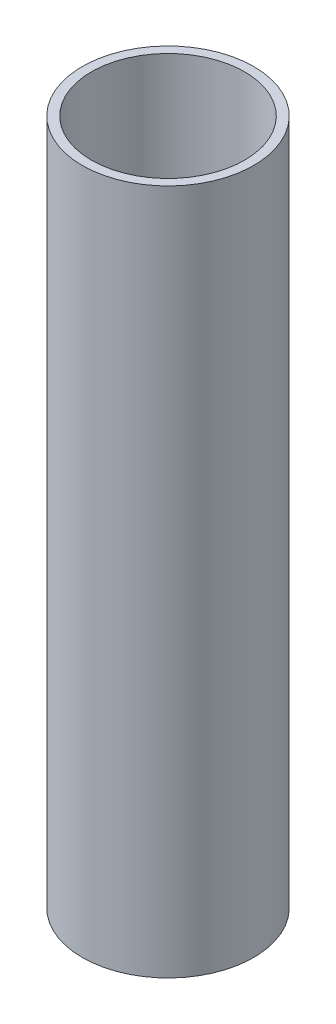
ISO-10303-21;
HEADER;
FILE_DESCRIPTION(('STEP AP214'),'2;1');
FILE_NAME('part.step','',(''),(''),'','','');
FILE_SCHEMA(('AUTOMOTIVE_DESIGN { 1 0 10303 214 1 1 1 1 }'));
ENDSEC;
DATA;
#1=APPLICATION_CONTEXT('core data for automotive mechanical design processes');
#2=APPLICATION_PROTOCOL_DEFINITION('international standard','automotive_design',2000,#1);
#3=PRODUCT_CONTEXT('',#1,'mechanical');
#4=PRODUCT('Part','Part','',(#3));
#5=PRODUCT_RELATED_PRODUCT_CATEGORY('part','',(#4));
#6=PRODUCT_DEFINITION_FORMATION('','',#4);
#7=PRODUCT_DEFINITION_CONTEXT('part definition',#1,'design');
#8=PRODUCT_DEFINITION('design','',#6,#7);
#9=PRODUCT_DEFINITION_SHAPE('','',#8);
#10=(LENGTH_UNIT() NAMED_UNIT(*) SI_UNIT(.MILLI.,.METRE.));
#11=(NAMED_UNIT(*) PLANE_ANGLE_UNIT() SI_UNIT($,.RADIAN.));
#12=(NAMED_UNIT(*) SI_UNIT($,.STERADIAN.) SOLID_ANGLE_UNIT());
#13=UNCERTAINTY_MEASURE_WITH_UNIT(LENGTH_MEASURE(1.E-05),#10,'distance_accuracy_value','');
#14=(GEOMETRIC_REPRESENTATION_CONTEXT(3) GLOBAL_UNCERTAINTY_ASSIGNED_CONTEXT((#13)) GLOBAL_UNIT_ASSIGNED_CONTEXT((#10,
#11,#12)) REPRESENTATION_CONTEXT('',''));
#15=CARTESIAN_POINT('',(0.,0.,0.));
#16=DIRECTION('',(0.,0.,1.));
#17=DIRECTION('',(1.,0.,0.));
#18=AXIS2_PLACEMENT_3D('',#15,#16,#17);
#19=CARTESIAN_POINT('',(0.,38.1,0.));
#20=DIRECTION('',(0.,1.,0.));
#21=DIRECTION('',(0.,0.,1.));
#22=AXIS2_PLACEMENT_3D('',#19,#20,#21);
#23=PLANE('',#22);
#24=CARTESIAN_POINT('',(0.,38.1,0.));
#25=DIRECTION('',(0.,1.,0.));
#26=DIRECTION('',(0.,0.,1.));
#27=AXIS2_PLACEMENT_3D('',#24,#25,#26);
#28=CIRCLE('',#27,4.7625);
#29=CARTESIAN_POINT('',(0.,38.1,4.7625));
#30=VERTEX_POINT('',#29);
#31=EDGE_CURVE('E10',#30,#30,#28,.T.);
#32=ORIENTED_EDGE('',*,*,#31,.T.);
#33=EDGE_LOOP('',(#32));
#34=FACE_BOUND('',#33,.T.);
#35=CARTESIAN_POINT('',(0.,38.1,0.));
#36=DIRECTION('',(0.,1.,0.));
#37=DIRECTION('',(0.,0.,1.));
#38=AXIS2_PLACEMENT_3D('',#35,#36,#37);
#39=CIRCLE('',#38,4.2545);
#40=CARTESIAN_POINT('',(0.,38.1,4.2545));
#41=VERTEX_POINT('',#40);
#42=EDGE_CURVE('E47',#41,#41,#39,.T.);
#43=ORIENTED_EDGE('',*,*,#42,.F.);
#44=EDGE_LOOP('',(#43));
#45=FACE_BOUND('',#44,.T.);
#46=ADVANCED_FACE('F36',(#34,#45),#23,.T.);
#47=CARTESIAN_POINT('',(0.,0.,0.));
#48=DIRECTION('',(0.,1.,0.));
#49=DIRECTION('',(0.,0.,1.));
#50=AXIS2_PLACEMENT_3D('',#47,#48,#49);
#51=PLANE('',#50);
#52=CARTESIAN_POINT('',(0.,0.,0.));
#53=DIRECTION('',(0.,1.,0.));
#54=DIRECTION('',(0.,0.,1.));
#55=AXIS2_PLACEMENT_3D('',#52,#53,#54);
#56=CIRCLE('',#55,4.7625);
#57=CARTESIAN_POINT('',(0.,0.,4.7625));
#58=VERTEX_POINT('',#57);
#59=EDGE_CURVE('E40',#58,#58,#56,.T.);
#60=ORIENTED_EDGE('',*,*,#59,.F.);
#61=EDGE_LOOP('',(#60));
#62=FACE_BOUND('',#61,.T.);
#63=CARTESIAN_POINT('',(0.,0.,0.));
#64=DIRECTION('',(0.,1.,0.));
#65=DIRECTION('',(0.,0.,1.));
#66=AXIS2_PLACEMENT_3D('',#63,#64,#65);
#67=CIRCLE('',#66,4.2545);
#68=CARTESIAN_POINT('',(0.,0.,4.2545));
#69=VERTEX_POINT('',#68);
#70=EDGE_CURVE('E49',#69,#69,#67,.T.);
#71=ORIENTED_EDGE('',*,*,#70,.T.);
#72=EDGE_LOOP('',(#71));
#73=FACE_BOUND('',#72,.T.);
#74=ADVANCED_FACE('F59',(#62,#73),#51,.F.);
#75=CARTESIAN_POINT('',(0.,38.1,0.));
#76=DIRECTION('',(0.,-1.,0.));
#77=DIRECTION('',(0.,0.,-1.));
#78=AXIS2_PLACEMENT_3D('',#75,#76,#77);
#79=CYLINDRICAL_SURFACE('',#78,4.7625);
#80=ORIENTED_EDGE('',*,*,#31,.F.);
#81=EDGE_LOOP('',(#80));
#82=FACE_BOUND('',#81,.T.);
#83=ORIENTED_EDGE('',*,*,#59,.T.);
#84=EDGE_LOOP('',(#83));
#85=FACE_BOUND('',#84,.T.);
#86=ADVANCED_FACE('F38',(#82,#85),#79,.T.);
#87=CARTESIAN_POINT('',(0.,38.1,0.));
#88=DIRECTION('',(0.,-1.,0.));
#89=DIRECTION('',(0.,0.,-1.));
#90=AXIS2_PLACEMENT_3D('',#87,#88,#89);
#91=CYLINDRICAL_SURFACE('',#90,4.2545);
#92=ORIENTED_EDGE('',*,*,#42,.T.);
#93=EDGE_LOOP('',(#92));
#94=FACE_BOUND('',#93,.T.);
#95=ORIENTED_EDGE('',*,*,#70,.F.);
#96=EDGE_LOOP('',(#95));
#97=FACE_BOUND('',#96,.T.);
#98=ADVANCED_FACE('F55',(#94,#97),#91,.F.);
#99=CLOSED_SHELL('',(#46,#74,#86,#98));
#100=MANIFOLD_SOLID_BREP('B2',#99);
#101=ADVANCED_BREP_SHAPE_REPRESENTATION('',(#18,#100),#14);
#102=SHAPE_DEFINITION_REPRESENTATION(#9,#101);
ENDSEC;
END-ISO-10303-21;
